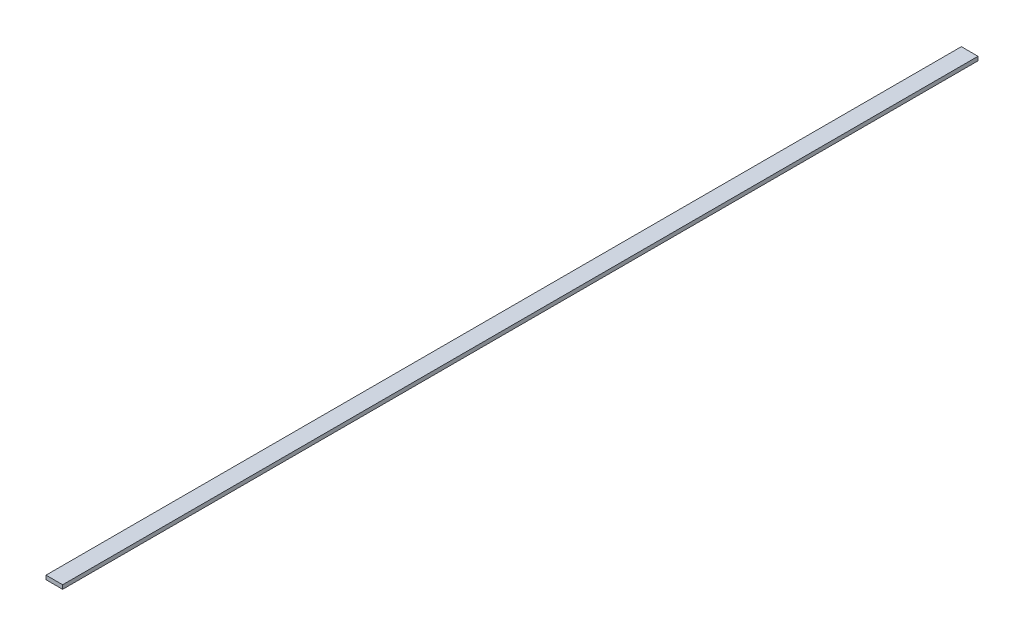
ISO-10303-21;
HEADER;
FILE_DESCRIPTION(('STEP AP214'),'2;1');
FILE_NAME('part.step','',(''),(''),'','','');
FILE_SCHEMA(('AUTOMOTIVE_DESIGN { 1 0 10303 214 1 1 1 1 }'));
ENDSEC;
DATA;
#1=APPLICATION_CONTEXT('core data for automotive mechanical design processes');
#2=APPLICATION_PROTOCOL_DEFINITION('international standard','automotive_design',2000,#1);
#3=PRODUCT_CONTEXT('',#1,'mechanical');
#4=PRODUCT('Part','Part','',(#3));
#5=PRODUCT_RELATED_PRODUCT_CATEGORY('part','',(#4));
#6=PRODUCT_DEFINITION_FORMATION('','',#4);
#7=PRODUCT_DEFINITION_CONTEXT('part definition',#1,'design');
#8=PRODUCT_DEFINITION('design','',#6,#7);
#9=PRODUCT_DEFINITION_SHAPE('','',#8);
#10=(LENGTH_UNIT() NAMED_UNIT(*) SI_UNIT(.MILLI.,.METRE.));
#11=(NAMED_UNIT(*) PLANE_ANGLE_UNIT() SI_UNIT($,.RADIAN.));
#12=(NAMED_UNIT(*) SI_UNIT($,.STERADIAN.) SOLID_ANGLE_UNIT());
#13=UNCERTAINTY_MEASURE_WITH_UNIT(LENGTH_MEASURE(1.E-05),#10,'distance_accuracy_value','');
#14=(GEOMETRIC_REPRESENTATION_CONTEXT(3) GLOBAL_UNCERTAINTY_ASSIGNED_CONTEXT((#13)) GLOBAL_UNIT_ASSIGNED_CONTEXT((#10,
#11,#12)) REPRESENTATION_CONTEXT('',''));
#15=CARTESIAN_POINT('',(0.,0.,0.));
#16=DIRECTION('',(0.,0.,1.));
#17=DIRECTION('',(1.,0.,0.));
#18=AXIS2_PLACEMENT_3D('',#15,#16,#17);
#19=CARTESIAN_POINT('',(0.,0.,349.25));
#20=DIRECTION('',(1.,0.,0.));
#21=DIRECTION('',(0.,0.,-1.));
#22=AXIS2_PLACEMENT_3D('',#19,#20,#21);
#23=PLANE('',#22);
#24=DIRECTION('',(0.,-1.,0.));
#25=VECTOR('',#24,1.);
#26=CARTESIAN_POINT('',(0.,0.,0.));
#27=LINE('',#26,#25);
#28=CARTESIAN_POINT('',(0.,1.51892,0.));
#29=VERTEX_POINT('',#28);
#30=CARTESIAN_POINT('',(0.,0.,0.));
#31=VERTEX_POINT('',#30);
#32=EDGE_CURVE('E107',#29,#31,#27,.T.);
#33=ORIENTED_EDGE('',*,*,#32,.T.);
#34=DIRECTION('',(0.,0.,-1.));
#35=VECTOR('',#34,1.);
#36=CARTESIAN_POINT('',(0.,0.,349.25));
#37=LINE('',#36,#35);
#38=CARTESIAN_POINT('',(0.,0.,349.25));
#39=VERTEX_POINT('',#38);
#40=EDGE_CURVE('E11',#39,#31,#37,.T.);
#41=ORIENTED_EDGE('',*,*,#40,.F.);
#42=DIRECTION('',(0.,-1.,0.));
#43=VECTOR('',#42,1.);
#44=CARTESIAN_POINT('',(0.,0.,349.25));
#45=LINE('',#44,#43);
#46=CARTESIAN_POINT('',(0.,1.51892,349.25));
#47=VERTEX_POINT('',#46);
#48=EDGE_CURVE('E91',#47,#39,#45,.T.);
#49=ORIENTED_EDGE('',*,*,#48,.F.);
#50=DIRECTION('',(0.,0.,-1.));
#51=VECTOR('',#50,1.);
#52=CARTESIAN_POINT('',(0.,1.51892,349.25));
#53=LINE('',#52,#51);
#54=EDGE_CURVE('E103',#47,#29,#53,.T.);
#55=ORIENTED_EDGE('',*,*,#54,.T.);
#56=EDGE_LOOP('',(#33,#41,#49,#55));
#57=FACE_BOUND('',#56,.T.);
#58=ADVANCED_FACE('F39',(#57),#23,.F.);
#59=CARTESIAN_POINT('',(0.,0.,349.25));
#60=DIRECTION('',(0.,1.,0.));
#61=DIRECTION('',(0.,0.,1.));
#62=AXIS2_PLACEMENT_3D('',#59,#60,#61);
#63=PLANE('',#62);
#64=DIRECTION('',(1.,0.,0.));
#65=VECTOR('',#64,1.);
#66=CARTESIAN_POINT('',(0.,0.,0.));
#67=LINE('',#66,#65);
#68=CARTESIAN_POINT('',(6.35,0.,0.));
#69=VERTEX_POINT('',#68);
#70=EDGE_CURVE('E96',#31,#69,#67,.T.);
#71=ORIENTED_EDGE('',*,*,#70,.T.);
#72=DIRECTION('',(0.,0.,-1.));
#73=VECTOR('',#72,1.);
#74=CARTESIAN_POINT('',(6.35,0.,349.25));
#75=LINE('',#74,#73);
#76=CARTESIAN_POINT('',(6.35,0.,349.25));
#77=VERTEX_POINT('',#76);
#78=EDGE_CURVE('E48',#77,#69,#75,.T.);
#79=ORIENTED_EDGE('',*,*,#78,.F.);
#80=DIRECTION('',(1.,0.,0.));
#81=VECTOR('',#80,1.);
#82=CARTESIAN_POINT('',(0.,0.,349.25));
#83=LINE('',#82,#81);
#84=EDGE_CURVE('E86',#39,#77,#83,.T.);
#85=ORIENTED_EDGE('',*,*,#84,.F.);
#86=ORIENTED_EDGE('',*,*,#40,.T.);
#87=EDGE_LOOP('',(#71,#79,#85,#86));
#88=FACE_BOUND('',#87,.T.);
#89=ADVANCED_FACE('F95',(#88),#63,.F.);
#90=CARTESIAN_POINT('',(6.35,0.,349.25));
#91=DIRECTION('',(-1.,0.,0.));
#92=DIRECTION('',(0.,0.,1.));
#93=AXIS2_PLACEMENT_3D('',#90,#91,#92);
#94=PLANE('',#93);
#95=DIRECTION('',(0.,1.,0.));
#96=VECTOR('',#95,1.);
#97=CARTESIAN_POINT('',(6.35,0.,0.));
#98=LINE('',#97,#96);
#99=CARTESIAN_POINT('',(6.35,1.51892,0.));
#100=VERTEX_POINT('',#99);
#101=EDGE_CURVE('E73',#69,#100,#98,.T.);
#102=ORIENTED_EDGE('',*,*,#101,.T.);
#103=DIRECTION('',(0.,0.,-1.));
#104=VECTOR('',#103,1.);
#105=CARTESIAN_POINT('',(6.35,1.51892,349.25));
#106=LINE('',#105,#104);
#107=CARTESIAN_POINT('',(6.35,1.51892,349.25));
#108=VERTEX_POINT('',#107);
#109=EDGE_CURVE('E98',#108,#100,#106,.T.);
#110=ORIENTED_EDGE('',*,*,#109,.F.);
#111=DIRECTION('',(0.,1.,0.));
#112=VECTOR('',#111,1.);
#113=CARTESIAN_POINT('',(6.35,0.,349.25));
#114=LINE('',#113,#112);
#115=EDGE_CURVE('E89',#77,#108,#114,.T.);
#116=ORIENTED_EDGE('',*,*,#115,.F.);
#117=ORIENTED_EDGE('',*,*,#78,.T.);
#118=EDGE_LOOP('',(#102,#110,#116,#117));
#119=FACE_BOUND('',#118,.T.);
#120=ADVANCED_FACE('F99',(#119),#94,.F.);
#121=CARTESIAN_POINT('',(0.,1.51892,349.25));
#122=DIRECTION('',(0.,-1.,0.));
#123=DIRECTION('',(0.,0.,-1.));
#124=AXIS2_PLACEMENT_3D('',#121,#122,#123);
#125=PLANE('',#124);
#126=DIRECTION('',(-1.,0.,0.));
#127=VECTOR('',#126,1.);
#128=CARTESIAN_POINT('',(0.,1.51892,0.));
#129=LINE('',#128,#127);
#130=EDGE_CURVE('E79',#100,#29,#129,.T.);
#131=ORIENTED_EDGE('',*,*,#130,.T.);
#132=ORIENTED_EDGE('',*,*,#54,.F.);
#133=DIRECTION('',(-1.,0.,0.));
#134=VECTOR('',#133,1.);
#135=CARTESIAN_POINT('',(0.,1.51892,349.25));
#136=LINE('',#135,#134);
#137=EDGE_CURVE('E56',#108,#47,#136,.T.);
#138=ORIENTED_EDGE('',*,*,#137,.F.);
#139=ORIENTED_EDGE('',*,*,#109,.T.);
#140=EDGE_LOOP('',(#131,#132,#138,#139));
#141=FACE_BOUND('',#140,.T.);
#142=ADVANCED_FACE('F120',(#141),#125,.F.);
#143=CARTESIAN_POINT('',(0.,0.,349.25));
#144=DIRECTION('',(0.,0.,-1.));
#145=DIRECTION('',(-1.,0.,0.));
#146=AXIS2_PLACEMENT_3D('',#143,#144,#145);
#147=PLANE('',#146);
#148=ORIENTED_EDGE('',*,*,#48,.T.);
#149=ORIENTED_EDGE('',*,*,#84,.T.);
#150=ORIENTED_EDGE('',*,*,#115,.T.);
#151=ORIENTED_EDGE('',*,*,#137,.T.);
#152=EDGE_LOOP('',(#148,#149,#150,#151));
#153=FACE_BOUND('',#152,.T.);
#154=ADVANCED_FACE('F87',(#153),#147,.F.);
#155=CARTESIAN_POINT('',(0.,0.,0.));
#156=DIRECTION('',(0.,0.,-1.));
#157=DIRECTION('',(-1.,0.,0.));
#158=AXIS2_PLACEMENT_3D('',#155,#156,#157);
#159=PLANE('',#158);
#160=ORIENTED_EDGE('',*,*,#32,.F.);
#161=ORIENTED_EDGE('',*,*,#130,.F.);
#162=ORIENTED_EDGE('',*,*,#101,.F.);
#163=ORIENTED_EDGE('',*,*,#70,.F.);
#164=EDGE_LOOP('',(#160,#161,#162,#163));
#165=FACE_BOUND('',#164,.T.);
#166=ADVANCED_FACE('F123',(#165),#159,.T.);
#167=CLOSED_SHELL('',(#58,#89,#120,#142,#154,#166));
#168=MANIFOLD_SOLID_BREP('B2',#167);
#169=ADVANCED_BREP_SHAPE_REPRESENTATION('',(#18,#168),#14);
#170=SHAPE_DEFINITION_REPRESENTATION(#9,#169);
ENDSEC;
END-ISO-10303-21;
